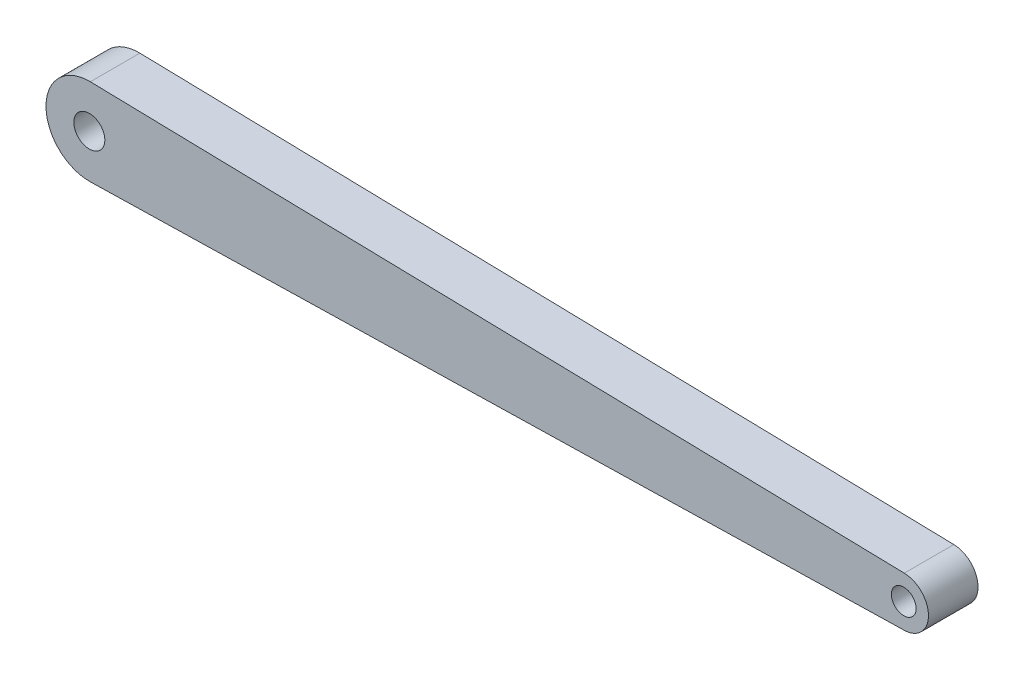
ISO-10303-21;
HEADER;
FILE_DESCRIPTION(('STEP AP214'),'2;1');
FILE_NAME('part.step','',(''),(''),'','','');
FILE_SCHEMA(('AUTOMOTIVE_DESIGN { 1 0 10303 214 1 1 1 1 }'));
ENDSEC;
DATA;
#1=APPLICATION_CONTEXT('core data for automotive mechanical design processes');
#2=APPLICATION_PROTOCOL_DEFINITION('international standard','automotive_design',2000,#1);
#3=PRODUCT_CONTEXT('',#1,'mechanical');
#4=PRODUCT('Part','Part','',(#3));
#5=PRODUCT_RELATED_PRODUCT_CATEGORY('part','',(#4));
#6=PRODUCT_DEFINITION_FORMATION('','',#4);
#7=PRODUCT_DEFINITION_CONTEXT('part definition',#1,'design');
#8=PRODUCT_DEFINITION('design','',#6,#7);
#9=PRODUCT_DEFINITION_SHAPE('','',#8);
#10=(LENGTH_UNIT() NAMED_UNIT(*) SI_UNIT(.MILLI.,.METRE.));
#11=(NAMED_UNIT(*) PLANE_ANGLE_UNIT() SI_UNIT($,.RADIAN.));
#12=(NAMED_UNIT(*) SI_UNIT($,.STERADIAN.) SOLID_ANGLE_UNIT());
#13=UNCERTAINTY_MEASURE_WITH_UNIT(LENGTH_MEASURE(1.E-05),#10,'distance_accuracy_value','');
#14=(GEOMETRIC_REPRESENTATION_CONTEXT(3) GLOBAL_UNCERTAINTY_ASSIGNED_CONTEXT((#13)) GLOBAL_UNIT_ASSIGNED_CONTEXT((#10,
#11,#12)) REPRESENTATION_CONTEXT('',''));
#15=CARTESIAN_POINT('',(0.,0.,0.));
#16=DIRECTION('',(0.,0.,1.));
#17=DIRECTION('',(1.,0.,0.));
#18=AXIS2_PLACEMENT_3D('',#15,#16,#17);
#19=CARTESIAN_POINT('',(-1315.,0.,40.));
#20=DIRECTION('',(0.,0.,1.));
#21=DIRECTION('',(1.,0.,0.));
#22=AXIS2_PLACEMENT_3D('',#19,#20,#21);
#23=PLANE('',#22);
#24=CARTESIAN_POINT('',(0.,0.,40.));
#25=DIRECTION('',(0.,0.,1.));
#26=DIRECTION('',(1.,0.,0.));
#27=AXIS2_PLACEMENT_3D('',#24,#25,#26);
#28=CIRCLE('',#27,20.);
#29=CARTESIAN_POINT('',(20.,0.,40.));
#30=VERTEX_POINT('',#29);
#31=EDGE_CURVE('E100',#30,#30,#28,.T.);
#32=ORIENTED_EDGE('',*,*,#31,.F.);
#33=EDGE_LOOP('',(#32));
#34=FACE_BOUND('',#33,.T.);
#35=CARTESIAN_POINT('',(-1315.,0.,40.));
#36=DIRECTION('',(0.,0.,1.));
#37=DIRECTION('',(1.,0.,0.));
#38=AXIS2_PLACEMENT_3D('',#35,#36,#37);
#39=CIRCLE('',#38,70.);
#40=CARTESIAN_POINT('',(-1313.40304182509,69.9817813762096,40.));
#41=VERTEX_POINT('',#40);
#42=CARTESIAN_POINT('',(-1313.40304182509,-69.9817813762097,40.));
#43=VERTEX_POINT('',#42);
#44=EDGE_CURVE('E85',#41,#43,#39,.T.);
#45=ORIENTED_EDGE('',*,*,#44,.T.);
#46=DIRECTION('',(0.999739733945852,0.0228136882129278,0.));
#47=VECTOR('',#46,1.);
#48=CARTESIAN_POINT('',(0.912547528517111,-39.9895893578341,40.));
#49=LINE('',#48,#47);
#50=CARTESIAN_POINT('',(0.912547528517138,-39.9895893578341,40.));
#51=VERTEX_POINT('',#50);
#52=EDGE_CURVE('E80',#43,#51,#49,.T.);
#53=ORIENTED_EDGE('',*,*,#52,.T.);
#54=CARTESIAN_POINT('',(0.,0.,40.));
#55=DIRECTION('',(0.,0.,1.));
#56=DIRECTION('',(-1.,0.,0.));
#57=AXIS2_PLACEMENT_3D('',#54,#55,#56);
#58=CIRCLE('',#57,40.);
#59=CARTESIAN_POINT('',(0.91254752851711,39.9895893578341,40.));
#60=VERTEX_POINT('',#59);
#61=EDGE_CURVE('E83',#51,#60,#58,.T.);
#62=ORIENTED_EDGE('',*,*,#61,.T.);
#63=DIRECTION('',(-0.999739733945852,0.0228136882129278,0.));
#64=VECTOR('',#63,1.);
#65=CARTESIAN_POINT('',(-1313.40304182509,69.9817813762096,40.));
#66=LINE('',#65,#64);
#67=EDGE_CURVE('E50',#60,#41,#66,.T.);
#68=ORIENTED_EDGE('',*,*,#67,.T.);
#69=EDGE_LOOP('',(#45,#53,#62,#68));
#70=FACE_BOUND('',#69,.T.);
#71=CARTESIAN_POINT('',(-1315.,0.,40.));
#72=DIRECTION('',(0.,0.,1.));
#73=DIRECTION('',(1.,0.,0.));
#74=AXIS2_PLACEMENT_3D('',#71,#72,#73);
#75=CIRCLE('',#74,25.);
#76=CARTESIAN_POINT('',(-1290.,0.,40.));
#77=VERTEX_POINT('',#76);
#78=EDGE_CURVE('E115',#77,#77,#75,.T.);
#79=ORIENTED_EDGE('',*,*,#78,.F.);
#80=EDGE_LOOP('',(#79));
#81=FACE_BOUND('',#80,.T.);
#82=ADVANCED_FACE('F33',(#34,#70,#81),#23,.T.);
#83=CARTESIAN_POINT('',(-1315.,0.,-40.));
#84=DIRECTION('',(0.,0.,1.));
#85=DIRECTION('',(1.,0.,0.));
#86=AXIS2_PLACEMENT_3D('',#83,#84,#85);
#87=PLANE('',#86);
#88=CARTESIAN_POINT('',(-1315.,0.,-40.));
#89=DIRECTION('',(0.,0.,1.));
#90=DIRECTION('',(1.,0.,0.));
#91=AXIS2_PLACEMENT_3D('',#88,#89,#90);
#92=CIRCLE('',#91,70.);
#93=CARTESIAN_POINT('',(-1313.40304182509,69.9817813762096,-40.));
#94=VERTEX_POINT('',#93);
#95=CARTESIAN_POINT('',(-1313.40304182509,-69.9817813762097,-40.));
#96=VERTEX_POINT('',#95);
#97=EDGE_CURVE('E97',#94,#96,#92,.T.);
#98=ORIENTED_EDGE('',*,*,#97,.F.);
#99=DIRECTION('',(-0.999739733945852,0.0228136882129278,0.));
#100=VECTOR('',#99,1.);
#101=CARTESIAN_POINT('',(-1313.40304182509,69.9817813762096,-40.));
#102=LINE('',#101,#100);
#103=CARTESIAN_POINT('',(0.91254752851711,39.9895893578341,-40.));
#104=VERTEX_POINT('',#103);
#105=EDGE_CURVE('E73',#104,#94,#102,.T.);
#106=ORIENTED_EDGE('',*,*,#105,.F.);
#107=CARTESIAN_POINT('',(0.,0.,-40.));
#108=DIRECTION('',(0.,0.,1.));
#109=DIRECTION('',(-1.,0.,0.));
#110=AXIS2_PLACEMENT_3D('',#107,#108,#109);
#111=CIRCLE('',#110,40.);
#112=CARTESIAN_POINT('',(0.912547528517138,-39.9895893578341,-40.));
#113=VERTEX_POINT('',#112);
#114=EDGE_CURVE('E67',#113,#104,#111,.T.);
#115=ORIENTED_EDGE('',*,*,#114,.F.);
#116=DIRECTION('',(0.999739733945852,0.0228136882129278,0.));
#117=VECTOR('',#116,1.);
#118=CARTESIAN_POINT('',(0.912547528517111,-39.9895893578341,-40.));
#119=LINE('',#118,#117);
#120=EDGE_CURVE('E89',#96,#113,#119,.T.);
#121=ORIENTED_EDGE('',*,*,#120,.F.);
#122=EDGE_LOOP('',(#98,#106,#115,#121));
#123=FACE_BOUND('',#122,.T.);
#124=CARTESIAN_POINT('',(0.,0.,-40.));
#125=DIRECTION('',(0.,0.,1.));
#126=DIRECTION('',(1.,0.,0.));
#127=AXIS2_PLACEMENT_3D('',#124,#125,#126);
#128=CIRCLE('',#127,20.);
#129=CARTESIAN_POINT('',(20.,0.,-40.));
#130=VERTEX_POINT('',#129);
#131=EDGE_CURVE('E112',#130,#130,#128,.T.);
#132=ORIENTED_EDGE('',*,*,#131,.T.);
#133=EDGE_LOOP('',(#132));
#134=FACE_BOUND('',#133,.T.);
#135=CARTESIAN_POINT('',(-1315.,0.,-40.));
#136=DIRECTION('',(0.,0.,1.));
#137=DIRECTION('',(1.,0.,0.));
#138=AXIS2_PLACEMENT_3D('',#135,#136,#137);
#139=CIRCLE('',#138,25.);
#140=CARTESIAN_POINT('',(-1290.,0.,-40.));
#141=VERTEX_POINT('',#140);
#142=EDGE_CURVE('E118',#141,#141,#139,.T.);
#143=ORIENTED_EDGE('',*,*,#142,.T.);
#144=EDGE_LOOP('',(#143));
#145=FACE_BOUND('',#144,.T.);
#146=ADVANCED_FACE('F108',(#123,#134,#145),#87,.F.);
#147=CARTESIAN_POINT('',(-1315.,0.,40.));
#148=DIRECTION('',(0.,0.,-1.));
#149=DIRECTION('',(-1.,0.,0.));
#150=AXIS2_PLACEMENT_3D('',#147,#148,#149);
#151=CYLINDRICAL_SURFACE('',#150,70.);
#152=ORIENTED_EDGE('',*,*,#97,.T.);
#153=DIRECTION('',(0.,0.,-1.));
#154=VECTOR('',#153,1.);
#155=CARTESIAN_POINT('',(-1313.40304182509,-69.9817813762097,40.));
#156=LINE('',#155,#154);
#157=EDGE_CURVE('E11',#43,#96,#156,.T.);
#158=ORIENTED_EDGE('',*,*,#157,.F.);
#159=ORIENTED_EDGE('',*,*,#44,.F.);
#160=DIRECTION('',(0.,0.,-1.));
#161=VECTOR('',#160,1.);
#162=CARTESIAN_POINT('',(-1313.40304182509,69.9817813762096,40.));
#163=LINE('',#162,#161);
#164=EDGE_CURVE('E93',#41,#94,#163,.T.);
#165=ORIENTED_EDGE('',*,*,#164,.T.);
#166=EDGE_LOOP('',(#152,#158,#159,#165));
#167=FACE_BOUND('',#166,.T.);
#168=ADVANCED_FACE('F35',(#167),#151,.T.);
#169=CARTESIAN_POINT('',(0.912547528517111,-39.9895893578341,40.));
#170=DIRECTION('',(-0.0228136882129278,0.999739733945852,0.));
#171=DIRECTION('',(-0.999739733945852,-0.0228136882129278,0.));
#172=AXIS2_PLACEMENT_3D('',#169,#170,#171);
#173=PLANE('',#172);
#174=ORIENTED_EDGE('',*,*,#120,.T.);
#175=DIRECTION('',(0.,0.,-1.));
#176=VECTOR('',#175,1.);
#177=CARTESIAN_POINT('',(0.912547528517138,-39.9895893578341,40.));
#178=LINE('',#177,#176);
#179=EDGE_CURVE('E42',#51,#113,#178,.T.);
#180=ORIENTED_EDGE('',*,*,#179,.F.);
#181=ORIENTED_EDGE('',*,*,#52,.F.);
#182=ORIENTED_EDGE('',*,*,#157,.T.);
#183=EDGE_LOOP('',(#174,#180,#181,#182));
#184=FACE_BOUND('',#183,.T.);
#185=ADVANCED_FACE('F88',(#184),#173,.F.);
#186=CARTESIAN_POINT('',(0.,0.,40.));
#187=DIRECTION('',(0.,0.,-1.));
#188=DIRECTION('',(-1.,0.,0.));
#189=AXIS2_PLACEMENT_3D('',#186,#187,#188);
#190=CYLINDRICAL_SURFACE('',#189,40.);
#191=ORIENTED_EDGE('',*,*,#114,.T.);
#192=DIRECTION('',(0.,0.,-1.));
#193=VECTOR('',#192,1.);
#194=CARTESIAN_POINT('',(0.91254752851711,39.9895893578341,40.));
#195=LINE('',#194,#193);
#196=EDGE_CURVE('E90',#60,#104,#195,.T.);
#197=ORIENTED_EDGE('',*,*,#196,.F.);
#198=ORIENTED_EDGE('',*,*,#61,.F.);
#199=ORIENTED_EDGE('',*,*,#179,.T.);
#200=EDGE_LOOP('',(#191,#197,#198,#199));
#201=FACE_BOUND('',#200,.T.);
#202=ADVANCED_FACE('F91',(#201),#190,.T.);
#203=CARTESIAN_POINT('',(-1313.40304182509,69.9817813762096,40.));
#204=DIRECTION('',(-0.0228136882129278,-0.999739733945852,0.));
#205=DIRECTION('',(0.999739733945852,-0.0228136882129278,0.));
#206=AXIS2_PLACEMENT_3D('',#203,#204,#205);
#207=PLANE('',#206);
#208=ORIENTED_EDGE('',*,*,#105,.T.);
#209=ORIENTED_EDGE('',*,*,#164,.F.);
#210=ORIENTED_EDGE('',*,*,#67,.F.);
#211=ORIENTED_EDGE('',*,*,#196,.T.);
#212=EDGE_LOOP('',(#208,#209,#210,#211));
#213=FACE_BOUND('',#212,.T.);
#214=ADVANCED_FACE('F105',(#213),#207,.F.);
#215=CARTESIAN_POINT('',(0.,0.,40.));
#216=DIRECTION('',(0.,0.,-1.));
#217=DIRECTION('',(-1.,0.,0.));
#218=AXIS2_PLACEMENT_3D('',#215,#216,#217);
#219=CYLINDRICAL_SURFACE('',#218,20.);
#220=ORIENTED_EDGE('',*,*,#31,.T.);
#221=EDGE_LOOP('',(#220));
#222=FACE_BOUND('',#221,.T.);
#223=ORIENTED_EDGE('',*,*,#131,.F.);
#224=EDGE_LOOP('',(#223));
#225=FACE_BOUND('',#224,.T.);
#226=ADVANCED_FACE('F135',(#222,#225),#219,.F.);
#227=CARTESIAN_POINT('',(-1315.,0.,40.));
#228=DIRECTION('',(0.,0.,-1.));
#229=DIRECTION('',(-1.,0.,0.));
#230=AXIS2_PLACEMENT_3D('',#227,#228,#229);
#231=CYLINDRICAL_SURFACE('',#230,25.);
#232=ORIENTED_EDGE('',*,*,#78,.T.);
#233=EDGE_LOOP('',(#232));
#234=FACE_BOUND('',#233,.T.);
#235=ORIENTED_EDGE('',*,*,#142,.F.);
#236=EDGE_LOOP('',(#235));
#237=FACE_BOUND('',#236,.T.);
#238=ADVANCED_FACE('F124',(#234,#237),#231,.F.);
#239=CLOSED_SHELL('',(#82,#146,#168,#185,#202,#214,#226,#238));
#240=MANIFOLD_SOLID_BREP('B2',#239);
#241=ADVANCED_BREP_SHAPE_REPRESENTATION('',(#18,#240),#14);
#242=SHAPE_DEFINITION_REPRESENTATION(#9,#241);
ENDSEC;
END-ISO-10303-21;
